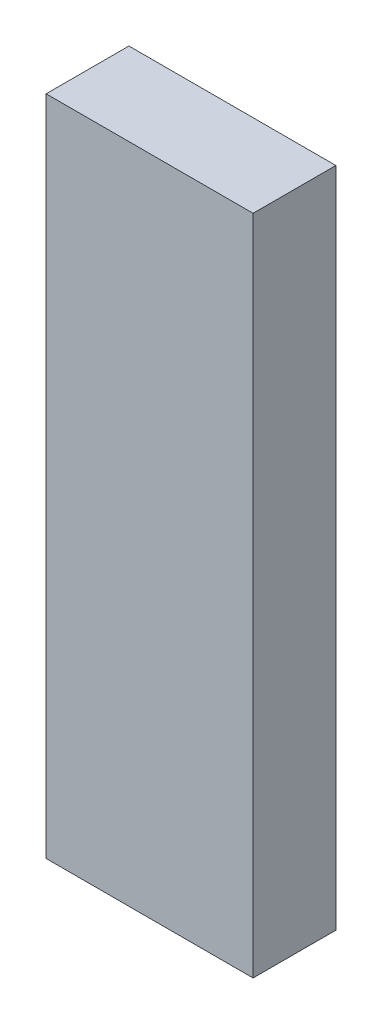
ISO-10303-21;
HEADER;
FILE_DESCRIPTION(('STEP AP214'),'2;1');
FILE_NAME('part.step','',(''),(''),'','','');
FILE_SCHEMA(('AUTOMOTIVE_DESIGN { 1 0 10303 214 1 1 1 1 }'));
ENDSEC;
DATA;
#1=APPLICATION_CONTEXT('core data for automotive mechanical design processes');
#2=APPLICATION_PROTOCOL_DEFINITION('international standard','automotive_design',2000,#1);
#3=PRODUCT_CONTEXT('',#1,'mechanical');
#4=PRODUCT('Part','Part','',(#3));
#5=PRODUCT_RELATED_PRODUCT_CATEGORY('part','',(#4));
#6=PRODUCT_DEFINITION_FORMATION('','',#4);
#7=PRODUCT_DEFINITION_CONTEXT('part definition',#1,'design');
#8=PRODUCT_DEFINITION('design','',#6,#7);
#9=PRODUCT_DEFINITION_SHAPE('','',#8);
#10=(LENGTH_UNIT() NAMED_UNIT(*) SI_UNIT(.MILLI.,.METRE.));
#11=(NAMED_UNIT(*) PLANE_ANGLE_UNIT() SI_UNIT($,.RADIAN.));
#12=(NAMED_UNIT(*) SI_UNIT($,.STERADIAN.) SOLID_ANGLE_UNIT());
#13=UNCERTAINTY_MEASURE_WITH_UNIT(LENGTH_MEASURE(1.E-05),#10,'distance_accuracy_value','');
#14=(GEOMETRIC_REPRESENTATION_CONTEXT(3) GLOBAL_UNCERTAINTY_ASSIGNED_CONTEXT((#13)) GLOBAL_UNIT_ASSIGNED_CONTEXT((#10,
#11,#12)) REPRESENTATION_CONTEXT('',''));
#15=CARTESIAN_POINT('',(0.,0.,0.));
#16=DIRECTION('',(0.,0.,1.));
#17=DIRECTION('',(1.,0.,0.));
#18=AXIS2_PLACEMENT_3D('',#15,#16,#17);
#19=CARTESIAN_POINT('',(31.75,101.6,12.7));
#20=DIRECTION('',(-1.,0.,0.));
#21=DIRECTION('',(0.,0.,1.));
#22=AXIS2_PLACEMENT_3D('',#19,#20,#21);
#23=PLANE('',#22);
#24=DIRECTION('',(0.,0.,-1.));
#25=VECTOR('',#24,1.);
#26=CARTESIAN_POINT('',(31.75,-101.6,12.7));
#27=LINE('',#26,#25);
#28=CARTESIAN_POINT('',(31.75,-101.6,12.7));
#29=VERTEX_POINT('',#28);
#30=CARTESIAN_POINT('',(31.75,-101.6,-12.7));
#31=VERTEX_POINT('',#30);
#32=EDGE_CURVE('E96',#29,#31,#27,.T.);
#33=ORIENTED_EDGE('',*,*,#32,.T.);
#34=DIRECTION('',(0.,-1.,0.));
#35=VECTOR('',#34,1.);
#36=CARTESIAN_POINT('',(31.75,101.6,-12.7));
#37=LINE('',#36,#35);
#38=CARTESIAN_POINT('',(31.75,101.6,-12.7));
#39=VERTEX_POINT('',#38);
#40=EDGE_CURVE('E11',#39,#31,#37,.T.);
#41=ORIENTED_EDGE('',*,*,#40,.F.);
#42=DIRECTION('',(0.,0.,-1.));
#43=VECTOR('',#42,1.);
#44=CARTESIAN_POINT('',(31.75,101.6,12.7));
#45=LINE('',#44,#43);
#46=CARTESIAN_POINT('',(31.75,101.6,12.7));
#47=VERTEX_POINT('',#46);
#48=EDGE_CURVE('E84',#47,#39,#45,.T.);
#49=ORIENTED_EDGE('',*,*,#48,.F.);
#50=DIRECTION('',(0.,-1.,0.));
#51=VECTOR('',#50,1.);
#52=CARTESIAN_POINT('',(31.75,101.6,12.7));
#53=LINE('',#52,#51);
#54=EDGE_CURVE('E92',#47,#29,#53,.T.);
#55=ORIENTED_EDGE('',*,*,#54,.T.);
#56=EDGE_LOOP('',(#33,#41,#49,#55));
#57=FACE_BOUND('',#56,.T.);
#58=ADVANCED_FACE('F33',(#57),#23,.F.);
#59=CARTESIAN_POINT('',(-31.75,101.6,-12.7));
#60=DIRECTION('',(0.,0.,1.));
#61=DIRECTION('',(1.,0.,0.));
#62=AXIS2_PLACEMENT_3D('',#59,#60,#61);
#63=PLANE('',#62);
#64=DIRECTION('',(-1.,0.,0.));
#65=VECTOR('',#64,1.);
#66=CARTESIAN_POINT('',(-31.75,-101.6,-12.7));
#67=LINE('',#66,#65);
#68=CARTESIAN_POINT('',(-31.75,-101.6,-12.7));
#69=VERTEX_POINT('',#68);
#70=EDGE_CURVE('E88',#31,#69,#67,.T.);
#71=ORIENTED_EDGE('',*,*,#70,.T.);
#72=DIRECTION('',(0.,-1.,0.));
#73=VECTOR('',#72,1.);
#74=CARTESIAN_POINT('',(-31.75,101.6,-12.7));
#75=LINE('',#74,#73);
#76=CARTESIAN_POINT('',(-31.75,101.6,-12.7));
#77=VERTEX_POINT('',#76);
#78=EDGE_CURVE('E41',#77,#69,#75,.T.);
#79=ORIENTED_EDGE('',*,*,#78,.F.);
#80=DIRECTION('',(-1.,0.,0.));
#81=VECTOR('',#80,1.);
#82=CARTESIAN_POINT('',(-31.75,101.6,-12.7));
#83=LINE('',#82,#81);
#84=EDGE_CURVE('E79',#39,#77,#83,.T.);
#85=ORIENTED_EDGE('',*,*,#84,.F.);
#86=ORIENTED_EDGE('',*,*,#40,.T.);
#87=EDGE_LOOP('',(#71,#79,#85,#86));
#88=FACE_BOUND('',#87,.T.);
#89=ADVANCED_FACE('F87',(#88),#63,.F.);
#90=CARTESIAN_POINT('',(-31.75,101.6,12.7));
#91=DIRECTION('',(1.,0.,0.));
#92=DIRECTION('',(0.,0.,-1.));
#93=AXIS2_PLACEMENT_3D('',#90,#91,#92);
#94=PLANE('',#93);
#95=DIRECTION('',(0.,0.,1.));
#96=VECTOR('',#95,1.);
#97=CARTESIAN_POINT('',(-31.75,-101.6,12.7));
#98=LINE('',#97,#96);
#99=CARTESIAN_POINT('',(-31.75,-101.6,12.7));
#100=VERTEX_POINT('',#99);
#101=EDGE_CURVE('E66',#69,#100,#98,.T.);
#102=ORIENTED_EDGE('',*,*,#101,.T.);
#103=DIRECTION('',(0.,-1.,0.));
#104=VECTOR('',#103,1.);
#105=CARTESIAN_POINT('',(-31.75,101.6,12.7));
#106=LINE('',#105,#104);
#107=CARTESIAN_POINT('',(-31.75,101.6,12.7));
#108=VERTEX_POINT('',#107);
#109=EDGE_CURVE('E89',#108,#100,#106,.T.);
#110=ORIENTED_EDGE('',*,*,#109,.F.);
#111=DIRECTION('',(0.,0.,1.));
#112=VECTOR('',#111,1.);
#113=CARTESIAN_POINT('',(-31.75,101.6,12.7));
#114=LINE('',#113,#112);
#115=EDGE_CURVE('E82',#77,#108,#114,.T.);
#116=ORIENTED_EDGE('',*,*,#115,.F.);
#117=ORIENTED_EDGE('',*,*,#78,.T.);
#118=EDGE_LOOP('',(#102,#110,#116,#117));
#119=FACE_BOUND('',#118,.T.);
#120=ADVANCED_FACE('F90',(#119),#94,.F.);
#121=CARTESIAN_POINT('',(-31.75,101.6,12.7));
#122=DIRECTION('',(0.,0.,-1.));
#123=DIRECTION('',(-1.,0.,0.));
#124=AXIS2_PLACEMENT_3D('',#121,#122,#123);
#125=PLANE('',#124);
#126=DIRECTION('',(1.,0.,0.));
#127=VECTOR('',#126,1.);
#128=CARTESIAN_POINT('',(-31.75,-101.6,12.7));
#129=LINE('',#128,#127);
#130=EDGE_CURVE('E72',#100,#29,#129,.T.);
#131=ORIENTED_EDGE('',*,*,#130,.T.);
#132=ORIENTED_EDGE('',*,*,#54,.F.);
#133=DIRECTION('',(1.,0.,0.));
#134=VECTOR('',#133,1.);
#135=CARTESIAN_POINT('',(-31.75,101.6,12.7));
#136=LINE('',#135,#134);
#137=EDGE_CURVE('E49',#108,#47,#136,.T.);
#138=ORIENTED_EDGE('',*,*,#137,.F.);
#139=ORIENTED_EDGE('',*,*,#109,.T.);
#140=EDGE_LOOP('',(#131,#132,#138,#139));
#141=FACE_BOUND('',#140,.T.);
#142=ADVANCED_FACE('F103',(#141),#125,.F.);
#143=CARTESIAN_POINT('',(0.,101.6,0.));
#144=DIRECTION('',(0.,-1.,0.));
#145=DIRECTION('',(0.,0.,-1.));
#146=AXIS2_PLACEMENT_3D('',#143,#144,#145);
#147=PLANE('',#146);
#148=ORIENTED_EDGE('',*,*,#48,.T.);
#149=ORIENTED_EDGE('',*,*,#84,.T.);
#150=ORIENTED_EDGE('',*,*,#115,.T.);
#151=ORIENTED_EDGE('',*,*,#137,.T.);
#152=EDGE_LOOP('',(#148,#149,#150,#151));
#153=FACE_BOUND('',#152,.T.);
#154=ADVANCED_FACE('F80',(#153),#147,.F.);
#155=CARTESIAN_POINT('',(0.,-101.6,0.));
#156=DIRECTION('',(0.,-1.,0.));
#157=DIRECTION('',(0.,0.,-1.));
#158=AXIS2_PLACEMENT_3D('',#155,#156,#157);
#159=PLANE('',#158);
#160=ORIENTED_EDGE('',*,*,#32,.F.);
#161=ORIENTED_EDGE('',*,*,#130,.F.);
#162=ORIENTED_EDGE('',*,*,#101,.F.);
#163=ORIENTED_EDGE('',*,*,#70,.F.);
#164=EDGE_LOOP('',(#160,#161,#162,#163));
#165=FACE_BOUND('',#164,.T.);
#166=ADVANCED_FACE('F106',(#165),#159,.T.);
#167=CLOSED_SHELL('',(#58,#89,#120,#142,#154,#166));
#168=MANIFOLD_SOLID_BREP('B2',#167);
#169=ADVANCED_BREP_SHAPE_REPRESENTATION('',(#18,#168),#14);
#170=SHAPE_DEFINITION_REPRESENTATION(#9,#169);
ENDSEC;
END-ISO-10303-21;
